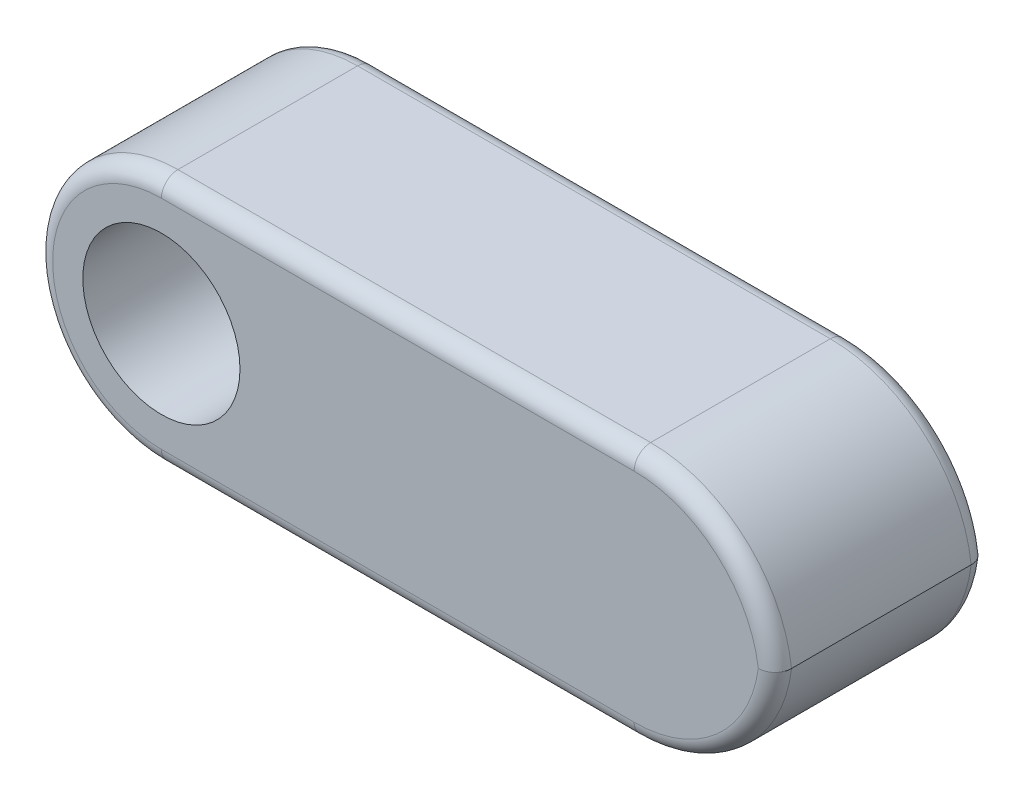
ISO-10303-21;
HEADER;
FILE_DESCRIPTION(('STEP AP214'),'2;1');
FILE_NAME('part.step','',(''),(''),'','','');
FILE_SCHEMA(('AUTOMOTIVE_DESIGN { 1 0 10303 214 1 1 1 1 }'));
ENDSEC;
DATA;
#1=APPLICATION_CONTEXT('core data for automotive mechanical design processes');
#2=APPLICATION_PROTOCOL_DEFINITION('international standard','automotive_design',2000,#1);
#3=PRODUCT_CONTEXT('',#1,'mechanical');
#4=PRODUCT('Part','Part','',(#3));
#5=PRODUCT_RELATED_PRODUCT_CATEGORY('part','',(#4));
#6=PRODUCT_DEFINITION_FORMATION('','',#4);
#7=PRODUCT_DEFINITION_CONTEXT('part definition',#1,'design');
#8=PRODUCT_DEFINITION('design','',#6,#7);
#9=PRODUCT_DEFINITION_SHAPE('','',#8);
#10=(LENGTH_UNIT() NAMED_UNIT(*) SI_UNIT(.MILLI.,.METRE.));
#11=(NAMED_UNIT(*) PLANE_ANGLE_UNIT() SI_UNIT($,.RADIAN.));
#12=(NAMED_UNIT(*) SI_UNIT($,.STERADIAN.) SOLID_ANGLE_UNIT());
#13=UNCERTAINTY_MEASURE_WITH_UNIT(LENGTH_MEASURE(1.E-05),#10,'distance_accuracy_value','');
#14=(GEOMETRIC_REPRESENTATION_CONTEXT(3) GLOBAL_UNCERTAINTY_ASSIGNED_CONTEXT((#13)) GLOBAL_UNIT_ASSIGNED_CONTEXT((#10,
#11,#12)) REPRESENTATION_CONTEXT('',''));
#15=CARTESIAN_POINT('',(0.,0.,0.));
#16=DIRECTION('',(0.,0.,1.));
#17=DIRECTION('',(1.,0.,0.));
#18=AXIS2_PLACEMENT_3D('',#15,#16,#17);
#19=CARTESIAN_POINT('',(0.,6.731,11.43));
#20=DIRECTION('',(0.,1.,0.));
#21=DIRECTION('',(0.,0.,1.));
#22=AXIS2_PLACEMENT_3D('',#19,#20,#21);
#23=PLANE('',#22);
#24=DIRECTION('',(0.,0.,-1.));
#25=VECTOR('',#24,1.);
#26=CARTESIAN_POINT('',(25.4,6.731,11.43));
#27=LINE('',#26,#25);
#28=CARTESIAN_POINT('',(25.4,6.731,10.541));
#29=VERTEX_POINT('',#28);
#30=CARTESIAN_POINT('',(25.4,6.731,0.889000000000001));
#31=VERTEX_POINT('',#30);
#32=EDGE_CURVE('E134',#29,#31,#27,.T.);
#33=ORIENTED_EDGE('',*,*,#32,.T.);
#34=DIRECTION('',(1.,0.,0.));
#35=VECTOR('',#34,1.);
#36=CARTESIAN_POINT('',(0.,6.731,0.889));
#37=LINE('',#36,#35);
#38=CARTESIAN_POINT('',(0.,6.731,0.889000000000001));
#39=VERTEX_POINT('',#38);
#40=EDGE_CURVE('E144',#31,#39,#37,.F.);
#41=ORIENTED_EDGE('',*,*,#40,.T.);
#42=DIRECTION('',(0.,0.,-1.));
#43=VECTOR('',#42,1.);
#44=CARTESIAN_POINT('',(0.,6.731,11.43));
#45=LINE('',#44,#43);
#46=CARTESIAN_POINT('',(0.,6.731,10.541));
#47=VERTEX_POINT('',#46);
#48=EDGE_CURVE('E149',#47,#39,#45,.T.);
#49=ORIENTED_EDGE('',*,*,#48,.F.);
#50=DIRECTION('',(1.,0.,0.));
#51=VECTOR('',#50,1.);
#52=CARTESIAN_POINT('',(0.,6.731,10.541));
#53=LINE('',#52,#51);
#54=EDGE_CURVE('E177',#47,#29,#53,.T.);
#55=ORIENTED_EDGE('',*,*,#54,.T.);
#56=EDGE_LOOP('',(#33,#41,#49,#55));
#57=FACE_BOUND('',#56,.T.);
#58=ADVANCED_FACE('F38',(#57),#23,.T.);
#59=CARTESIAN_POINT('',(0.,0.,11.43));
#60=DIRECTION('',(0.,0.,-1.));
#61=DIRECTION('',(-1.,0.,0.));
#62=AXIS2_PLACEMENT_3D('',#59,#60,#61);
#63=CYLINDRICAL_SURFACE('',#62,6.731);
#64=ORIENTED_EDGE('',*,*,#48,.T.);
#65=CARTESIAN_POINT('',(0.,0.,0.889000000000001));
#66=DIRECTION('',(0.,0.,1.));
#67=DIRECTION('',(1.,0.,0.));
#68=AXIS2_PLACEMENT_3D('',#65,#66,#67);
#69=CIRCLE('',#68,6.731);
#70=CARTESIAN_POINT('',(0.,-6.731,0.889000000000001));
#71=VERTEX_POINT('',#70);
#72=EDGE_CURVE('E133',#39,#71,#69,.T.);
#73=ORIENTED_EDGE('',*,*,#72,.T.);
#74=DIRECTION('',(0.,0.,-1.));
#75=VECTOR('',#74,1.);
#76=CARTESIAN_POINT('',(0.,-6.731,11.43));
#77=LINE('',#76,#75);
#78=CARTESIAN_POINT('',(0.,-6.731,10.541));
#79=VERTEX_POINT('',#78);
#80=EDGE_CURVE('E140',#79,#71,#77,.T.);
#81=ORIENTED_EDGE('',*,*,#80,.F.);
#82=CARTESIAN_POINT('',(0.,0.,10.541));
#83=DIRECTION('',(0.,0.,1.));
#84=DIRECTION('',(1.,0.,0.));
#85=AXIS2_PLACEMENT_3D('',#82,#83,#84);
#86=CIRCLE('',#85,6.731);
#87=EDGE_CURVE('E125',#79,#47,#86,.F.);
#88=ORIENTED_EDGE('',*,*,#87,.T.);
#89=EDGE_LOOP('',(#64,#73,#81,#88));
#90=FACE_BOUND('',#89,.T.);
#91=ADVANCED_FACE('F147',(#90),#63,.T.);
#92=CARTESIAN_POINT('',(0.,-6.731,11.43));
#93=DIRECTION('',(0.,1.,0.));
#94=DIRECTION('',(0.,0.,1.));
#95=AXIS2_PLACEMENT_3D('',#92,#93,#94);
#96=PLANE('',#95);
#97=ORIENTED_EDGE('',*,*,#80,.T.);
#98=DIRECTION('',(1.,0.,0.));
#99=VECTOR('',#98,1.);
#100=CARTESIAN_POINT('',(0.,-6.731,0.889000000000001));
#101=LINE('',#100,#99);
#102=CARTESIAN_POINT('',(25.4,-6.731,0.889000000000001));
#103=VERTEX_POINT('',#102);
#104=EDGE_CURVE('E143',#71,#103,#101,.T.);
#105=ORIENTED_EDGE('',*,*,#104,.T.);
#106=DIRECTION('',(0.,0.,-1.));
#107=VECTOR('',#106,1.);
#108=CARTESIAN_POINT('',(25.4,-6.731,11.43));
#109=LINE('',#108,#107);
#110=CARTESIAN_POINT('',(25.4,-6.731,10.541));
#111=VERTEX_POINT('',#110);
#112=EDGE_CURVE('E142',#103,#111,#109,.F.);
#113=ORIENTED_EDGE('',*,*,#112,.T.);
#114=DIRECTION('',(1.,0.,0.));
#115=VECTOR('',#114,1.);
#116=CARTESIAN_POINT('',(0.,-6.731,10.541));
#117=LINE('',#116,#115);
#118=EDGE_CURVE('E119',#111,#79,#117,.F.);
#119=ORIENTED_EDGE('',*,*,#118,.T.);
#120=EDGE_LOOP('',(#97,#105,#113,#119));
#121=FACE_BOUND('',#120,.T.);
#122=ADVANCED_FACE('F139',(#121),#96,.F.);
#123=CARTESIAN_POINT('',(0.,0.,11.43));
#124=DIRECTION('',(0.,0.,-1.));
#125=DIRECTION('',(-1.,0.,0.));
#126=AXIS2_PLACEMENT_3D('',#123,#124,#125);
#127=CYLINDRICAL_SURFACE('',#126,4.22275);
#128=CARTESIAN_POINT('',(0.,0.,11.43));
#129=DIRECTION('',(0.,0.,1.));
#130=DIRECTION('',(1.,0.,0.));
#131=AXIS2_PLACEMENT_3D('',#128,#129,#130);
#132=CIRCLE('',#131,4.22275);
#133=CARTESIAN_POINT('',(4.22275,0.,11.43));
#134=VERTEX_POINT('',#133);
#135=EDGE_CURVE('E150',#134,#134,#132,.T.);
#136=ORIENTED_EDGE('',*,*,#135,.T.);
#137=EDGE_LOOP('',(#136));
#138=FACE_BOUND('',#137,.T.);
#139=CARTESIAN_POINT('',(0.,0.,0.));
#140=DIRECTION('',(0.,0.,1.));
#141=DIRECTION('',(1.,0.,0.));
#142=AXIS2_PLACEMENT_3D('',#139,#140,#141);
#143=CIRCLE('',#142,4.22275);
#144=CARTESIAN_POINT('',(4.22275,0.,0.));
#145=VERTEX_POINT('',#144);
#146=EDGE_CURVE('E154',#145,#145,#143,.T.);
#147=ORIENTED_EDGE('',*,*,#146,.F.);
#148=EDGE_LOOP('',(#147));
#149=FACE_BOUND('',#148,.T.);
#150=ADVANCED_FACE('F250',(#138,#149),#127,.F.);
#151=CARTESIAN_POINT('',(0.,0.,11.43));
#152=DIRECTION('',(0.,0.,1.));
#153=DIRECTION('',(1.,0.,0.));
#154=AXIS2_PLACEMENT_3D('',#151,#152,#153);
#155=PLANE('',#154);
#156=CARTESIAN_POINT('',(0.,0.,11.43));
#157=DIRECTION('',(0.,0.,1.));
#158=DIRECTION('',(1.,0.,0.));
#159=AXIS2_PLACEMENT_3D('',#156,#157,#158);
#160=CIRCLE('',#159,5.842);
#161=CARTESIAN_POINT('',(0.,5.842,11.43));
#162=VERTEX_POINT('',#161);
#163=CARTESIAN_POINT('',(0.,-5.842,11.43));
#164=VERTEX_POINT('',#163);
#165=EDGE_CURVE('E191',#162,#164,#160,.T.);
#166=ORIENTED_EDGE('',*,*,#165,.T.);
#167=DIRECTION('',(1.,0.,0.));
#168=VECTOR('',#167,1.);
#169=CARTESIAN_POINT('',(25.4,-5.842,11.43));
#170=LINE('',#169,#168);
#171=CARTESIAN_POINT('',(25.4,-5.842,11.43));
#172=VERTEX_POINT('',#171);
#173=EDGE_CURVE('E11',#164,#172,#170,.T.);
#174=ORIENTED_EDGE('',*,*,#173,.T.);
#175=CARTESIAN_POINT('',(25.4,0.888999999999999,11.43));
#176=DIRECTION('',(0.,0.,1.));
#177=DIRECTION('',(1.,0.,0.));
#178=AXIS2_PLACEMENT_3D('',#175,#176,#177);
#179=CIRCLE('',#178,6.731);
#180=CARTESIAN_POINT('',(32.0720341725744,0.,11.43));
#181=VERTEX_POINT('',#180);
#182=EDGE_CURVE('E47',#172,#181,#179,.T.);
#183=ORIENTED_EDGE('',*,*,#182,.T.);
#184=CARTESIAN_POINT('',(25.4,-0.888999999999999,11.43));
#185=DIRECTION('',(0.,0.,1.));
#186=DIRECTION('',(1.,0.,0.));
#187=AXIS2_PLACEMENT_3D('',#184,#185,#186);
#188=CIRCLE('',#187,6.731);
#189=CARTESIAN_POINT('',(25.4,5.842,11.43));
#190=VERTEX_POINT('',#189);
#191=EDGE_CURVE('E193',#181,#190,#188,.T.);
#192=ORIENTED_EDGE('',*,*,#191,.T.);
#193=DIRECTION('',(1.,0.,0.));
#194=VECTOR('',#193,1.);
#195=CARTESIAN_POINT('',(0.,5.842,11.43));
#196=LINE('',#195,#194);
#197=EDGE_CURVE('E189',#190,#162,#196,.F.);
#198=ORIENTED_EDGE('',*,*,#197,.T.);
#199=EDGE_LOOP('',(#166,#174,#183,#192,#198));
#200=FACE_BOUND('',#199,.T.);
#201=ORIENTED_EDGE('',*,*,#135,.F.);
#202=EDGE_LOOP('',(#201));
#203=FACE_BOUND('',#202,.T.);
#204=ADVANCED_FACE('F246',(#200,#203),#155,.T.);
#205=CARTESIAN_POINT('',(0.,0.,0.));
#206=DIRECTION('',(0.,0.,1.));
#207=DIRECTION('',(1.,0.,0.));
#208=AXIS2_PLACEMENT_3D('',#205,#206,#207);
#209=PLANE('',#208);
#210=DIRECTION('',(1.,0.,0.));
#211=VECTOR('',#210,1.);
#212=CARTESIAN_POINT('',(0.,-5.842,0.));
#213=LINE('',#212,#211);
#214=CARTESIAN_POINT('',(25.4,-5.842,0.));
#215=VERTEX_POINT('',#214);
#216=CARTESIAN_POINT('',(0.,-5.842,0.));
#217=VERTEX_POINT('',#216);
#218=EDGE_CURVE('E170',#215,#217,#213,.F.);
#219=ORIENTED_EDGE('',*,*,#218,.T.);
#220=CARTESIAN_POINT('',(0.,0.,0.));
#221=DIRECTION('',(0.,0.,1.));
#222=DIRECTION('',(1.,0.,0.));
#223=AXIS2_PLACEMENT_3D('',#220,#221,#222);
#224=CIRCLE('',#223,5.842);
#225=CARTESIAN_POINT('',(0.,5.842,0.));
#226=VERTEX_POINT('',#225);
#227=EDGE_CURVE('E174',#217,#226,#224,.F.);
#228=ORIENTED_EDGE('',*,*,#227,.T.);
#229=DIRECTION('',(1.,0.,0.));
#230=VECTOR('',#229,1.);
#231=CARTESIAN_POINT('',(25.4,5.842,0.));
#232=LINE('',#231,#230);
#233=CARTESIAN_POINT('',(25.4,5.842,0.));
#234=VERTEX_POINT('',#233);
#235=EDGE_CURVE('E172',#226,#234,#232,.T.);
#236=ORIENTED_EDGE('',*,*,#235,.T.);
#237=CARTESIAN_POINT('',(25.4,-0.888999999999999,0.));
#238=DIRECTION('',(0.,0.,1.));
#239=DIRECTION('',(1.,0.,0.));
#240=AXIS2_PLACEMENT_3D('',#237,#238,#239);
#241=CIRCLE('',#240,6.731);
#242=CARTESIAN_POINT('',(32.0720341725744,0.,0.));
#243=VERTEX_POINT('',#242);
#244=EDGE_CURVE('E166',#234,#243,#241,.F.);
#245=ORIENTED_EDGE('',*,*,#244,.T.);
#246=CARTESIAN_POINT('',(25.4,0.888999999999999,0.));
#247=DIRECTION('',(0.,0.,1.));
#248=DIRECTION('',(1.,0.,0.));
#249=AXIS2_PLACEMENT_3D('',#246,#247,#248);
#250=CIRCLE('',#249,6.731);
#251=EDGE_CURVE('E168',#243,#215,#250,.F.);
#252=ORIENTED_EDGE('',*,*,#251,.T.);
#253=EDGE_LOOP('',(#219,#228,#236,#245,#252));
#254=FACE_BOUND('',#253,.T.);
#255=ORIENTED_EDGE('',*,*,#146,.T.);
#256=EDGE_LOOP('',(#255));
#257=FACE_BOUND('',#256,.T.);
#258=ADVANCED_FACE('F249',(#254,#257),#209,.F.);
#259=CARTESIAN_POINT('',(25.4,-0.888999999999999,11.43));
#260=DIRECTION('',(0.,0.,-1.));
#261=DIRECTION('',(-1.,0.,0.));
#262=AXIS2_PLACEMENT_3D('',#259,#260,#261);
#263=CYLINDRICAL_SURFACE('',#262,7.62);
#264=DIRECTION('',(0.,0.,-1.));
#265=VECTOR('',#264,1.);
#266=CARTESIAN_POINT('',(32.9679639930433,0.,5.715));
#267=LINE('',#266,#265);
#268=CARTESIAN_POINT('',(32.9679639930433,0.,0.889000000000001));
#269=VERTEX_POINT('',#268);
#270=CARTESIAN_POINT('',(32.9679639930433,0.,10.541));
#271=VERTEX_POINT('',#270);
#272=EDGE_CURVE('E161',#269,#271,#267,.F.);
#273=ORIENTED_EDGE('',*,*,#272,.F.);
#274=CARTESIAN_POINT('',(25.4,-0.888999999999999,0.889000000000001));
#275=DIRECTION('',(0.,0.,1.));
#276=DIRECTION('',(1.,0.,0.));
#277=AXIS2_PLACEMENT_3D('',#274,#275,#276);
#278=CIRCLE('',#277,7.62);
#279=EDGE_CURVE('E187',#269,#31,#278,.T.);
#280=ORIENTED_EDGE('',*,*,#279,.T.);
#281=ORIENTED_EDGE('',*,*,#32,.F.);
#282=CARTESIAN_POINT('',(25.4,-0.888999999999999,10.541));
#283=DIRECTION('',(0.,0.,1.));
#284=DIRECTION('',(1.,0.,0.));
#285=AXIS2_PLACEMENT_3D('',#282,#283,#284);
#286=CIRCLE('',#285,7.62);
#287=EDGE_CURVE('E185',#29,#271,#286,.F.);
#288=ORIENTED_EDGE('',*,*,#287,.T.);
#289=EDGE_LOOP('',(#273,#280,#281,#288));
#290=FACE_BOUND('',#289,.T.);
#291=ADVANCED_FACE('F261',(#290),#263,.T.);
#292=CARTESIAN_POINT('',(25.4,0.888999999999999,11.43));
#293=DIRECTION('',(0.,0.,1.));
#294=DIRECTION('',(1.,0.,0.));
#295=AXIS2_PLACEMENT_3D('',#292,#293,#294);
#296=CYLINDRICAL_SURFACE('',#295,7.62);
#297=ORIENTED_EDGE('',*,*,#112,.F.);
#298=CARTESIAN_POINT('',(25.4,0.888999999999999,0.889000000000001));
#299=DIRECTION('',(0.,0.,1.));
#300=DIRECTION('',(1.,0.,0.));
#301=AXIS2_PLACEMENT_3D('',#298,#299,#300);
#302=CIRCLE('',#301,7.62);
#303=EDGE_CURVE('E183',#103,#269,#302,.T.);
#304=ORIENTED_EDGE('',*,*,#303,.T.);
#305=ORIENTED_EDGE('',*,*,#272,.T.);
#306=CARTESIAN_POINT('',(25.4,0.888999999999999,10.541));
#307=DIRECTION('',(0.,0.,1.));
#308=DIRECTION('',(1.,0.,0.));
#309=AXIS2_PLACEMENT_3D('',#306,#307,#308);
#310=CIRCLE('',#309,7.62);
#311=EDGE_CURVE('E181',#271,#111,#310,.F.);
#312=ORIENTED_EDGE('',*,*,#311,.T.);
#313=EDGE_LOOP('',(#297,#304,#305,#312));
#314=FACE_BOUND('',#313,.T.);
#315=ADVANCED_FACE('F267',(#314),#296,.T.);
#316=CARTESIAN_POINT('',(25.4,-0.888999999999999,0.889000000000001));
#317=DIRECTION('',(0.,0.,1.));
#318=DIRECTION('',(1.,0.,0.));
#319=AXIS2_PLACEMENT_3D('',#316,#317,#318);
#320=TOROIDAL_SURFACE('',#319,6.731,0.889);
#321=CARTESIAN_POINT('',(25.4,5.842,0.889000000000001));
#322=DIRECTION('',(-1.,0.,0.));
#323=DIRECTION('',(0.,0.,1.));
#324=AXIS2_PLACEMENT_3D('',#321,#322,#323);
#325=CIRCLE('',#324,0.889);
#326=EDGE_CURVE('E203',#31,#234,#325,.T.);
#327=ORIENTED_EDGE('',*,*,#326,.F.);
#328=ORIENTED_EDGE('',*,*,#279,.F.);
#329=CARTESIAN_POINT('',(32.9679639930433,0.,0.889000000000001));
#330=CARTESIAN_POINT('',(32.9680077406932,0.,0.839244247298493));
#331=CARTESIAN_POINT('',(32.9637608418208,0.,0.789502982638975));
#332=CARTESIAN_POINT('',(32.9470101016479,0.,0.691474579644665));
#333=CARTESIAN_POINT('',(32.9345136886735,0.,0.643186173937087));
#334=CARTESIAN_POINT('',(32.9015803466428,0.,0.549374658582467));
#335=CARTESIAN_POINT('',(32.8811401122732,0.,0.503852709148598));
#336=CARTESIAN_POINT('',(32.8329347560299,0.,0.416881892126079));
#337=CARTESIAN_POINT('',(32.8051709888501,0.,0.375432273189355));
#338=CARTESIAN_POINT('',(32.7430310879237,0.,0.297641960257173));
#339=CARTESIAN_POINT('',(32.7086370493954,0.,0.261315572051254));
#340=CARTESIAN_POINT('',(32.6342619466457,0.,0.19489579032215));
#341=CARTESIAN_POINT('',(32.5942790300412,0.,0.164804471598455));
#342=CARTESIAN_POINT('',(32.5095880269359,0.,0.111503433983705));
#343=CARTESIAN_POINT('',(32.4648496655455,0.,0.0883418883946038));
#344=CARTESIAN_POINT('',(32.3721536911827,0.,0.049812313953461));
#345=CARTESIAN_POINT('',(32.3241984525589,0.,0.0344386071049091));
#346=CARTESIAN_POINT('',(32.2438990574758,0.,0.0158936596954657));
#347=CARTESIAN_POINT('',(32.2120846701148,0.,0.0103260934774058));
#348=CARTESIAN_POINT('',(32.1480754290879,0.,0.00262711967895243));
#349=CARTESIAN_POINT('',(32.1158812679023,0.,0.00049021227701343));
#350=CARTESIAN_POINT('',(32.0798031966287,0.,2.49602749300282E-05));
#351=CARTESIAN_POINT('',(32.0759184889046,0.,-6.57255074945522E-08));
#352=CARTESIAN_POINT('',(32.0720341725744,0.,0.));
#353=B_SPLINE_CURVE_WITH_KNOTS('',3,(#329,#330,#331,#332,#333,#334,#335,#336,#337,#338,#339,
#340,#341,#342,#343,#344,#345,#346,#347,#348,#349,#350,#351,#352),.UNSPECIFIED.,.F.,.F.,(4,2,2,
2,2,2,2,2,2,2,2,4),(0.,0.149065238018438,0.297996432071697,0.446989660780189,0.595955348297657,
0.745329094264183,0.894752466719904,1.04519165168623,1.19552099526285,1.29225484785677,
1.38883346726218,1.40048745252625),.UNSPECIFIED.);
#354=EDGE_CURVE('E163',#243,#269,#353,.F.);
#355=ORIENTED_EDGE('',*,*,#354,.F.);
#356=ORIENTED_EDGE('',*,*,#244,.F.);
#357=EDGE_LOOP('',(#327,#328,#355,#356));
#358=FACE_BOUND('',#357,.T.);
#359=ADVANCED_FACE('F214',(#358),#320,.T.);
#360=CARTESIAN_POINT('',(25.4,0.888999999999999,0.889000000000001));
#361=DIRECTION('',(0.,0.,1.));
#362=DIRECTION('',(1.,0.,0.));
#363=AXIS2_PLACEMENT_3D('',#360,#361,#362);
#364=TOROIDAL_SURFACE('',#363,6.731,0.889);
#365=ORIENTED_EDGE('',*,*,#354,.T.);
#366=ORIENTED_EDGE('',*,*,#303,.F.);
#367=CARTESIAN_POINT('',(25.4,-5.842,0.889));
#368=DIRECTION('',(-1.,0.,0.));
#369=DIRECTION('',(0.,0.,1.));
#370=AXIS2_PLACEMENT_3D('',#367,#368,#369);
#371=CIRCLE('',#370,0.889);
#372=EDGE_CURVE('E200',#215,#103,#371,.T.);
#373=ORIENTED_EDGE('',*,*,#372,.F.);
#374=ORIENTED_EDGE('',*,*,#251,.F.);
#375=EDGE_LOOP('',(#365,#366,#373,#374));
#376=FACE_BOUND('',#375,.T.);
#377=ADVANCED_FACE('F217',(#376),#364,.T.);
#378=CARTESIAN_POINT('',(0.,5.842,0.889));
#379=DIRECTION('',(-1.,0.,0.));
#380=DIRECTION('',(0.,0.,1.));
#381=AXIS2_PLACEMENT_3D('',#378,#379,#380);
#382=CYLINDRICAL_SURFACE('',#381,0.889);
#383=ORIENTED_EDGE('',*,*,#326,.T.);
#384=ORIENTED_EDGE('',*,*,#235,.F.);
#385=CARTESIAN_POINT('',(0.,5.842,0.889));
#386=DIRECTION('',(-1.,0.,0.));
#387=DIRECTION('',(0.,0.,1.));
#388=AXIS2_PLACEMENT_3D('',#385,#386,#387);
#389=CIRCLE('',#388,0.889);
#390=EDGE_CURVE('E198',#39,#226,#389,.T.);
#391=ORIENTED_EDGE('',*,*,#390,.F.);
#392=ORIENTED_EDGE('',*,*,#40,.F.);
#393=EDGE_LOOP('',(#383,#384,#391,#392));
#394=FACE_BOUND('',#393,.T.);
#395=ADVANCED_FACE('F221',(#394),#382,.T.);
#396=CARTESIAN_POINT('',(0.,-5.842,0.889000000000001));
#397=DIRECTION('',(1.,0.,0.));
#398=DIRECTION('',(0.,0.,-1.));
#399=AXIS2_PLACEMENT_3D('',#396,#397,#398);
#400=CYLINDRICAL_SURFACE('',#399,0.889);
#401=ORIENTED_EDGE('',*,*,#372,.T.);
#402=ORIENTED_EDGE('',*,*,#104,.F.);
#403=CARTESIAN_POINT('',(0.,-5.842,0.889));
#404=DIRECTION('',(-1.,0.,0.));
#405=DIRECTION('',(0.,0.,1.));
#406=AXIS2_PLACEMENT_3D('',#403,#404,#405);
#407=CIRCLE('',#406,0.889);
#408=EDGE_CURVE('E196',#217,#71,#407,.T.);
#409=ORIENTED_EDGE('',*,*,#408,.F.);
#410=ORIENTED_EDGE('',*,*,#218,.F.);
#411=EDGE_LOOP('',(#401,#402,#409,#410));
#412=FACE_BOUND('',#411,.T.);
#413=ADVANCED_FACE('F285',(#412),#400,.T.);
#414=CARTESIAN_POINT('',(0.,0.,0.889000000000001));
#415=DIRECTION('',(0.,0.,1.));
#416=DIRECTION('',(1.,0.,0.));
#417=AXIS2_PLACEMENT_3D('',#414,#415,#416);
#418=TOROIDAL_SURFACE('',#417,5.842,0.889);
#419=ORIENTED_EDGE('',*,*,#390,.T.);
#420=ORIENTED_EDGE('',*,*,#227,.F.);
#421=ORIENTED_EDGE('',*,*,#408,.T.);
#422=ORIENTED_EDGE('',*,*,#72,.F.);
#423=EDGE_LOOP('',(#419,#420,#421,#422));
#424=FACE_BOUND('',#423,.T.);
#425=ADVANCED_FACE('F282',(#424),#418,.T.);
#426=CARTESIAN_POINT('',(0.,5.842,10.541));
#427=DIRECTION('',(1.,0.,0.));
#428=DIRECTION('',(0.,0.,-1.));
#429=AXIS2_PLACEMENT_3D('',#426,#427,#428);
#430=CYLINDRICAL_SURFACE('',#429,0.889);
#431=CARTESIAN_POINT('',(0.,5.842,10.541));
#432=DIRECTION('',(-1.,0.,0.));
#433=DIRECTION('',(0.,0.,1.));
#434=AXIS2_PLACEMENT_3D('',#431,#432,#433);
#435=CIRCLE('',#434,0.889);
#436=EDGE_CURVE('E128',#162,#47,#435,.T.);
#437=ORIENTED_EDGE('',*,*,#436,.F.);
#438=ORIENTED_EDGE('',*,*,#197,.F.);
#439=CARTESIAN_POINT('',(25.4,5.842,10.541));
#440=DIRECTION('',(1.,0.,0.));
#441=DIRECTION('',(0.,0.,-1.));
#442=AXIS2_PLACEMENT_3D('',#439,#440,#441);
#443=CIRCLE('',#442,0.889);
#444=EDGE_CURVE('E42',#29,#190,#443,.T.);
#445=ORIENTED_EDGE('',*,*,#444,.F.);
#446=ORIENTED_EDGE('',*,*,#54,.F.);
#447=EDGE_LOOP('',(#437,#438,#445,#446));
#448=FACE_BOUND('',#447,.T.);
#449=ADVANCED_FACE('F40',(#448),#430,.T.);
#450=CARTESIAN_POINT('',(25.4,-0.888999999999999,10.541));
#451=DIRECTION('',(0.,0.,1.));
#452=DIRECTION('',(1.,0.,0.));
#453=AXIS2_PLACEMENT_3D('',#450,#451,#452);
#454=TOROIDAL_SURFACE('',#453,6.731,0.889);
#455=ORIENTED_EDGE('',*,*,#444,.T.);
#456=ORIENTED_EDGE('',*,*,#191,.F.);
#457=CARTESIAN_POINT('',(32.9679639930433,0.,10.541));
#458=CARTESIAN_POINT('',(32.9680077406932,0.,10.5907557527015));
#459=CARTESIAN_POINT('',(32.9637608418208,0.,10.640497017361));
#460=CARTESIAN_POINT('',(32.9470101016479,0.,10.7385254203553));
#461=CARTESIAN_POINT('',(32.9345136886735,0.,10.7868138260629));
#462=CARTESIAN_POINT('',(32.9015803466428,0.,10.8806253414175));
#463=CARTESIAN_POINT('',(32.8811401122732,0.,10.9261472908514));
#464=CARTESIAN_POINT('',(32.8329347560299,0.,11.0131181078739));
#465=CARTESIAN_POINT('',(32.8051709888501,0.,11.0545677268106));
#466=CARTESIAN_POINT('',(32.7430310879237,0.,11.1323580397428));
#467=CARTESIAN_POINT('',(32.7086370493954,0.,11.1686844279487));
#468=CARTESIAN_POINT('',(32.6342619466457,0.,11.2351042096778));
#469=CARTESIAN_POINT('',(32.5942790300412,0.,11.2651955284015));
#470=CARTESIAN_POINT('',(32.5095880269359,0.,11.3184965660163));
#471=CARTESIAN_POINT('',(32.4648496655455,0.,11.3416581116054));
#472=CARTESIAN_POINT('',(32.3721536911827,0.,11.3801876860465));
#473=CARTESIAN_POINT('',(32.3241984525589,0.,11.3955613928951));
#474=CARTESIAN_POINT('',(32.2438990574758,0.,11.4141063403045));
#475=CARTESIAN_POINT('',(32.2120846701147,0.,11.4196739065226));
#476=CARTESIAN_POINT('',(32.1480754290879,0.,11.427372880321));
#477=CARTESIAN_POINT('',(32.1158812679023,0.,11.429509787723));
#478=CARTESIAN_POINT('',(32.0798031966287,0.,11.4299750397251));
#479=CARTESIAN_POINT('',(32.0759184889046,0.,11.4300000657255));
#480=CARTESIAN_POINT('',(32.0720341725744,0.,11.43));
#481=B_SPLINE_CURVE_WITH_KNOTS('',3,(#457,#458,#459,#460,#461,#462,#463,#464,#465,#466,#467,
#468,#469,#470,#471,#472,#473,#474,#475,#476,#477,#478,#479,#480),.UNSPECIFIED.,.F.,.F.,(4,2,2,
2,2,2,2,2,2,2,2,4),(0.,0.149065238018436,0.297996432071697,0.446989660780188,0.595955348297657,
0.745329094264183,0.894752466719904,1.04519165168623,1.19552099526285,1.29225484785677,
1.38883346726218,1.40048745252625),.UNSPECIFIED.);
#482=EDGE_CURVE('E122',#271,#181,#481,.T.);
#483=ORIENTED_EDGE('',*,*,#482,.F.);
#484=ORIENTED_EDGE('',*,*,#287,.F.);
#485=EDGE_LOOP('',(#455,#456,#483,#484));
#486=FACE_BOUND('',#485,.T.);
#487=ADVANCED_FACE('F230',(#486),#454,.T.);
#488=CARTESIAN_POINT('',(0.,0.,10.541));
#489=DIRECTION('',(0.,0.,1.));
#490=DIRECTION('',(1.,0.,0.));
#491=AXIS2_PLACEMENT_3D('',#488,#489,#490);
#492=TOROIDAL_SURFACE('',#491,5.842,0.889);
#493=ORIENTED_EDGE('',*,*,#436,.T.);
#494=ORIENTED_EDGE('',*,*,#87,.F.);
#495=CARTESIAN_POINT('',(0.,-5.842,10.541));
#496=DIRECTION('',(1.,0.,0.));
#497=DIRECTION('',(0.,0.,-1.));
#498=AXIS2_PLACEMENT_3D('',#495,#496,#497);
#499=CIRCLE('',#498,0.889);
#500=EDGE_CURVE('E115',#164,#79,#499,.T.);
#501=ORIENTED_EDGE('',*,*,#500,.F.);
#502=ORIENTED_EDGE('',*,*,#165,.F.);
#503=EDGE_LOOP('',(#493,#494,#501,#502));
#504=FACE_BOUND('',#503,.T.);
#505=ADVANCED_FACE('F126',(#504),#492,.T.);
#506=CARTESIAN_POINT('',(25.4,0.888999999999999,10.541));
#507=DIRECTION('',(0.,0.,1.));
#508=DIRECTION('',(1.,0.,0.));
#509=AXIS2_PLACEMENT_3D('',#506,#507,#508);
#510=TOROIDAL_SURFACE('',#509,6.731,0.889);
#511=ORIENTED_EDGE('',*,*,#482,.T.);
#512=ORIENTED_EDGE('',*,*,#182,.F.);
#513=CARTESIAN_POINT('',(25.4,-5.842,10.541));
#514=DIRECTION('',(-1.,0.,0.));
#515=DIRECTION('',(0.,0.,1.));
#516=AXIS2_PLACEMENT_3D('',#513,#514,#515);
#517=CIRCLE('',#516,0.889);
#518=EDGE_CURVE('E55',#111,#172,#517,.T.);
#519=ORIENTED_EDGE('',*,*,#518,.F.);
#520=ORIENTED_EDGE('',*,*,#311,.F.);
#521=EDGE_LOOP('',(#511,#512,#519,#520));
#522=FACE_BOUND('',#521,.T.);
#523=ADVANCED_FACE('F225',(#522),#510,.T.);
#524=CARTESIAN_POINT('',(0.,-5.842,10.541));
#525=DIRECTION('',(-1.,0.,0.));
#526=DIRECTION('',(0.,0.,1.));
#527=AXIS2_PLACEMENT_3D('',#524,#525,#526);
#528=CYLINDRICAL_SURFACE('',#527,0.889);
#529=ORIENTED_EDGE('',*,*,#500,.T.);
#530=ORIENTED_EDGE('',*,*,#118,.F.);
#531=ORIENTED_EDGE('',*,*,#518,.T.);
#532=ORIENTED_EDGE('',*,*,#173,.F.);
#533=EDGE_LOOP('',(#529,#530,#531,#532));
#534=FACE_BOUND('',#533,.T.);
#535=ADVANCED_FACE('F117',(#534),#528,.T.);
#536=CLOSED_SHELL('',(#58,#91,#122,#150,#204,#258,#291,#315,#359,#377,#395,#413,#425,#449,#487,
#505,#523,#535));
#537=MANIFOLD_SOLID_BREP('B2',#536);
#538=ADVANCED_BREP_SHAPE_REPRESENTATION('',(#18,#537),#14);
#539=SHAPE_DEFINITION_REPRESENTATION(#9,#538);
ENDSEC;
END-ISO-10303-21;
